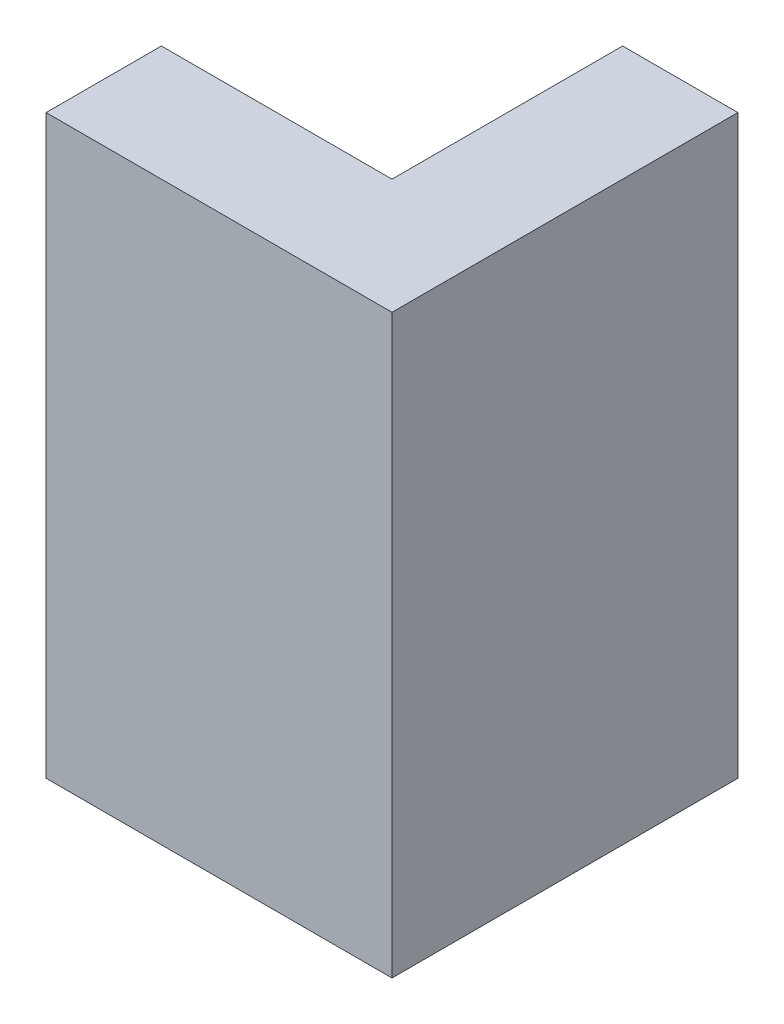
ISO-10303-21;
HEADER;
FILE_DESCRIPTION(('STEP AP214'),'2;1');
FILE_NAME('part.step','',(''),(''),'','','');
FILE_SCHEMA(('AUTOMOTIVE_DESIGN { 1 0 10303 214 1 1 1 1 }'));
ENDSEC;
DATA;
#1=APPLICATION_CONTEXT('core data for automotive mechanical design processes');
#2=APPLICATION_PROTOCOL_DEFINITION('international standard','automotive_design',2000,#1);
#3=PRODUCT_CONTEXT('',#1,'mechanical');
#4=PRODUCT('Part','Part','',(#3));
#5=PRODUCT_RELATED_PRODUCT_CATEGORY('part','',(#4));
#6=PRODUCT_DEFINITION_FORMATION('','',#4);
#7=PRODUCT_DEFINITION_CONTEXT('part definition',#1,'design');
#8=PRODUCT_DEFINITION('design','',#6,#7);
#9=PRODUCT_DEFINITION_SHAPE('','',#8);
#10=(LENGTH_UNIT() NAMED_UNIT(*) SI_UNIT(.MILLI.,.METRE.));
#11=(NAMED_UNIT(*) PLANE_ANGLE_UNIT() SI_UNIT($,.RADIAN.));
#12=(NAMED_UNIT(*) SI_UNIT($,.STERADIAN.) SOLID_ANGLE_UNIT());
#13=UNCERTAINTY_MEASURE_WITH_UNIT(LENGTH_MEASURE(1.E-05),#10,'distance_accuracy_value','');
#14=(GEOMETRIC_REPRESENTATION_CONTEXT(3) GLOBAL_UNCERTAINTY_ASSIGNED_CONTEXT((#13)) GLOBAL_UNIT_ASSIGNED_CONTEXT((#10,
#11,#12)) REPRESENTATION_CONTEXT('',''));
#15=CARTESIAN_POINT('',(0.,0.,0.));
#16=DIRECTION('',(0.,0.,1.));
#17=DIRECTION('',(1.,0.,0.));
#18=AXIS2_PLACEMENT_3D('',#15,#16,#17);
#19=CARTESIAN_POINT('',(60.,100.,0.));
#20=DIRECTION('',(-1.,0.,0.));
#21=DIRECTION('',(0.,0.,1.));
#22=AXIS2_PLACEMENT_3D('',#19,#20,#21);
#23=PLANE('',#22);
#24=DIRECTION('',(0.,0.,-1.));
#25=VECTOR('',#24,1.);
#26=CARTESIAN_POINT('',(60.,0.,0.));
#27=LINE('',#26,#25);
#28=CARTESIAN_POINT('',(60.,0.,0.));
#29=VERTEX_POINT('',#28);
#30=CARTESIAN_POINT('',(60.,0.,-60.));
#31=VERTEX_POINT('',#30);
#32=EDGE_CURVE('E119',#29,#31,#27,.T.);
#33=ORIENTED_EDGE('',*,*,#32,.T.);
#34=DIRECTION('',(0.,-1.,0.));
#35=VECTOR('',#34,1.);
#36=CARTESIAN_POINT('',(60.,100.,-60.));
#37=LINE('',#36,#35);
#38=CARTESIAN_POINT('',(60.,100.,-60.));
#39=VERTEX_POINT('',#38);
#40=EDGE_CURVE('E11',#39,#31,#37,.T.);
#41=ORIENTED_EDGE('',*,*,#40,.F.);
#42=DIRECTION('',(0.,0.,-1.));
#43=VECTOR('',#42,1.);
#44=CARTESIAN_POINT('',(60.,100.,0.));
#45=LINE('',#44,#43);
#46=CARTESIAN_POINT('',(60.,100.,0.));
#47=VERTEX_POINT('',#46);
#48=EDGE_CURVE('E129',#47,#39,#45,.T.);
#49=ORIENTED_EDGE('',*,*,#48,.F.);
#50=DIRECTION('',(0.,-1.,0.));
#51=VECTOR('',#50,1.);
#52=CARTESIAN_POINT('',(60.,100.,0.));
#53=LINE('',#52,#51);
#54=EDGE_CURVE('E115',#47,#29,#53,.T.);
#55=ORIENTED_EDGE('',*,*,#54,.T.);
#56=EDGE_LOOP('',(#33,#41,#49,#55));
#57=FACE_BOUND('',#56,.T.);
#58=ADVANCED_FACE('F35',(#57),#23,.F.);
#59=CARTESIAN_POINT('',(0.,100.,-60.));
#60=DIRECTION('',(0.,0.,1.));
#61=DIRECTION('',(1.,0.,0.));
#62=AXIS2_PLACEMENT_3D('',#59,#60,#61);
#63=PLANE('',#62);
#64=DIRECTION('',(-1.,0.,0.));
#65=VECTOR('',#64,1.);
#66=CARTESIAN_POINT('',(0.,0.,-60.));
#67=LINE('',#66,#65);
#68=CARTESIAN_POINT('',(40.,0.,-60.));
#69=VERTEX_POINT('',#68);
#70=EDGE_CURVE('E122',#31,#69,#67,.T.);
#71=ORIENTED_EDGE('',*,*,#70,.T.);
#72=DIRECTION('',(0.,-1.,0.));
#73=VECTOR('',#72,1.);
#74=CARTESIAN_POINT('',(40.,100.,-60.));
#75=LINE('',#74,#73);
#76=CARTESIAN_POINT('',(40.,100.,-60.));
#77=VERTEX_POINT('',#76);
#78=EDGE_CURVE('E43',#77,#69,#75,.T.);
#79=ORIENTED_EDGE('',*,*,#78,.F.);
#80=DIRECTION('',(-1.,0.,0.));
#81=VECTOR('',#80,1.);
#82=CARTESIAN_POINT('',(0.,100.,-60.));
#83=LINE('',#82,#81);
#84=EDGE_CURVE('E88',#39,#77,#83,.T.);
#85=ORIENTED_EDGE('',*,*,#84,.F.);
#86=ORIENTED_EDGE('',*,*,#40,.T.);
#87=EDGE_LOOP('',(#71,#79,#85,#86));
#88=FACE_BOUND('',#87,.T.);
#89=ADVANCED_FACE('F153',(#88),#63,.F.);
#90=CARTESIAN_POINT('',(40.,100.,0.));
#91=DIRECTION('',(1.,0.,0.));
#92=DIRECTION('',(0.,0.,-1.));
#93=AXIS2_PLACEMENT_3D('',#90,#91,#92);
#94=PLANE('',#93);
#95=DIRECTION('',(0.,0.,1.));
#96=VECTOR('',#95,1.);
#97=CARTESIAN_POINT('',(40.,0.,0.));
#98=LINE('',#97,#96);
#99=CARTESIAN_POINT('',(40.,0.,-20.));
#100=VERTEX_POINT('',#99);
#101=EDGE_CURVE('E124',#69,#100,#98,.T.);
#102=ORIENTED_EDGE('',*,*,#101,.T.);
#103=DIRECTION('',(0.,-1.,0.));
#104=VECTOR('',#103,1.);
#105=CARTESIAN_POINT('',(40.,100.,-20.));
#106=LINE('',#105,#104);
#107=CARTESIAN_POINT('',(40.,100.,-20.));
#108=VERTEX_POINT('',#107);
#109=EDGE_CURVE('E110',#108,#100,#106,.T.);
#110=ORIENTED_EDGE('',*,*,#109,.F.);
#111=DIRECTION('',(0.,0.,1.));
#112=VECTOR('',#111,1.);
#113=CARTESIAN_POINT('',(40.,100.,0.));
#114=LINE('',#113,#112);
#115=EDGE_CURVE('E101',#77,#108,#114,.T.);
#116=ORIENTED_EDGE('',*,*,#115,.F.);
#117=ORIENTED_EDGE('',*,*,#78,.T.);
#118=EDGE_LOOP('',(#102,#110,#116,#117));
#119=FACE_BOUND('',#118,.T.);
#120=ADVANCED_FACE('F135',(#119),#94,.F.);
#121=CARTESIAN_POINT('',(0.,100.,-20.));
#122=DIRECTION('',(0.,0.,1.));
#123=DIRECTION('',(1.,0.,0.));
#124=AXIS2_PLACEMENT_3D('',#121,#122,#123);
#125=PLANE('',#124);
#126=DIRECTION('',(-1.,0.,0.));
#127=VECTOR('',#126,1.);
#128=CARTESIAN_POINT('',(0.,0.,-20.));
#129=LINE('',#128,#127);
#130=CARTESIAN_POINT('',(0.,0.,-20.));
#131=VERTEX_POINT('',#130);
#132=EDGE_CURVE('E109',#100,#131,#129,.T.);
#133=ORIENTED_EDGE('',*,*,#132,.T.);
#134=DIRECTION('',(0.,-1.,0.));
#135=VECTOR('',#134,1.);
#136=CARTESIAN_POINT('',(0.,100.,-20.));
#137=LINE('',#136,#135);
#138=CARTESIAN_POINT('',(0.,100.,-20.));
#139=VERTEX_POINT('',#138);
#140=EDGE_CURVE('E106',#139,#131,#137,.T.);
#141=ORIENTED_EDGE('',*,*,#140,.F.);
#142=DIRECTION('',(-1.,0.,0.));
#143=VECTOR('',#142,1.);
#144=CARTESIAN_POINT('',(0.,100.,-20.));
#145=LINE('',#144,#143);
#146=EDGE_CURVE('E95',#108,#139,#145,.T.);
#147=ORIENTED_EDGE('',*,*,#146,.F.);
#148=ORIENTED_EDGE('',*,*,#109,.T.);
#149=EDGE_LOOP('',(#133,#141,#147,#148));
#150=FACE_BOUND('',#149,.T.);
#151=ADVANCED_FACE('F107',(#150),#125,.F.);
#152=CARTESIAN_POINT('',(0.,100.,0.));
#153=DIRECTION('',(1.,0.,0.));
#154=DIRECTION('',(0.,0.,-1.));
#155=AXIS2_PLACEMENT_3D('',#152,#153,#154);
#156=PLANE('',#155);
#157=DIRECTION('',(0.,0.,1.));
#158=VECTOR('',#157,1.);
#159=CARTESIAN_POINT('',(0.,0.,0.));
#160=LINE('',#159,#158);
#161=CARTESIAN_POINT('',(0.,0.,0.));
#162=VERTEX_POINT('',#161);
#163=EDGE_CURVE('E74',#131,#162,#160,.T.);
#164=ORIENTED_EDGE('',*,*,#163,.T.);
#165=DIRECTION('',(0.,-1.,0.));
#166=VECTOR('',#165,1.);
#167=CARTESIAN_POINT('',(0.,100.,0.));
#168=LINE('',#167,#166);
#169=CARTESIAN_POINT('',(0.,100.,0.));
#170=VERTEX_POINT('',#169);
#171=EDGE_CURVE('E111',#170,#162,#168,.T.);
#172=ORIENTED_EDGE('',*,*,#171,.F.);
#173=DIRECTION('',(0.,0.,1.));
#174=VECTOR('',#173,1.);
#175=CARTESIAN_POINT('',(0.,100.,0.));
#176=LINE('',#175,#174);
#177=EDGE_CURVE('E99',#139,#170,#176,.T.);
#178=ORIENTED_EDGE('',*,*,#177,.F.);
#179=ORIENTED_EDGE('',*,*,#140,.T.);
#180=EDGE_LOOP('',(#164,#172,#178,#179));
#181=FACE_BOUND('',#180,.T.);
#182=ADVANCED_FACE('F113',(#181),#156,.F.);
#183=CARTESIAN_POINT('',(0.,100.,0.));
#184=DIRECTION('',(0.,0.,-1.));
#185=DIRECTION('',(-1.,0.,0.));
#186=AXIS2_PLACEMENT_3D('',#183,#184,#185);
#187=PLANE('',#186);
#188=DIRECTION('',(1.,0.,0.));
#189=VECTOR('',#188,1.);
#190=CARTESIAN_POINT('',(0.,0.,0.));
#191=LINE('',#190,#189);
#192=EDGE_CURVE('E80',#162,#29,#191,.T.);
#193=ORIENTED_EDGE('',*,*,#192,.T.);
#194=ORIENTED_EDGE('',*,*,#54,.F.);
#195=DIRECTION('',(1.,0.,0.));
#196=VECTOR('',#195,1.);
#197=CARTESIAN_POINT('',(0.,100.,0.));
#198=LINE('',#197,#196);
#199=EDGE_CURVE('E51',#170,#47,#198,.T.);
#200=ORIENTED_EDGE('',*,*,#199,.F.);
#201=ORIENTED_EDGE('',*,*,#171,.T.);
#202=EDGE_LOOP('',(#193,#194,#200,#201));
#203=FACE_BOUND('',#202,.T.);
#204=ADVANCED_FACE('F142',(#203),#187,.F.);
#205=CARTESIAN_POINT('',(0.,100.,0.));
#206=DIRECTION('',(0.,1.,0.));
#207=DIRECTION('',(0.,0.,1.));
#208=AXIS2_PLACEMENT_3D('',#205,#206,#207);
#209=PLANE('',#208);
#210=ORIENTED_EDGE('',*,*,#48,.T.);
#211=ORIENTED_EDGE('',*,*,#84,.T.);
#212=ORIENTED_EDGE('',*,*,#115,.T.);
#213=ORIENTED_EDGE('',*,*,#146,.T.);
#214=ORIENTED_EDGE('',*,*,#177,.T.);
#215=ORIENTED_EDGE('',*,*,#199,.T.);
#216=EDGE_LOOP('',(#210,#211,#212,#213,#214,#215));
#217=FACE_BOUND('',#216,.T.);
#218=ADVANCED_FACE('F97',(#217),#209,.T.);
#219=CARTESIAN_POINT('',(0.,0.,0.));
#220=DIRECTION('',(0.,1.,0.));
#221=DIRECTION('',(0.,0.,1.));
#222=AXIS2_PLACEMENT_3D('',#219,#220,#221);
#223=PLANE('',#222);
#224=ORIENTED_EDGE('',*,*,#32,.F.);
#225=ORIENTED_EDGE('',*,*,#192,.F.);
#226=ORIENTED_EDGE('',*,*,#163,.F.);
#227=ORIENTED_EDGE('',*,*,#132,.F.);
#228=ORIENTED_EDGE('',*,*,#101,.F.);
#229=ORIENTED_EDGE('',*,*,#70,.F.);
#230=EDGE_LOOP('',(#224,#225,#226,#227,#228,#229));
#231=FACE_BOUND('',#230,.T.);
#232=ADVANCED_FACE('F138',(#231),#223,.F.);
#233=CLOSED_SHELL('',(#58,#89,#120,#151,#182,#204,#218,#232));
#234=MANIFOLD_SOLID_BREP('B2',#233);
#235=ADVANCED_BREP_SHAPE_REPRESENTATION('',(#18,#234),#14);
#236=SHAPE_DEFINITION_REPRESENTATION(#9,#235);
ENDSEC;
END-ISO-10303-21;
